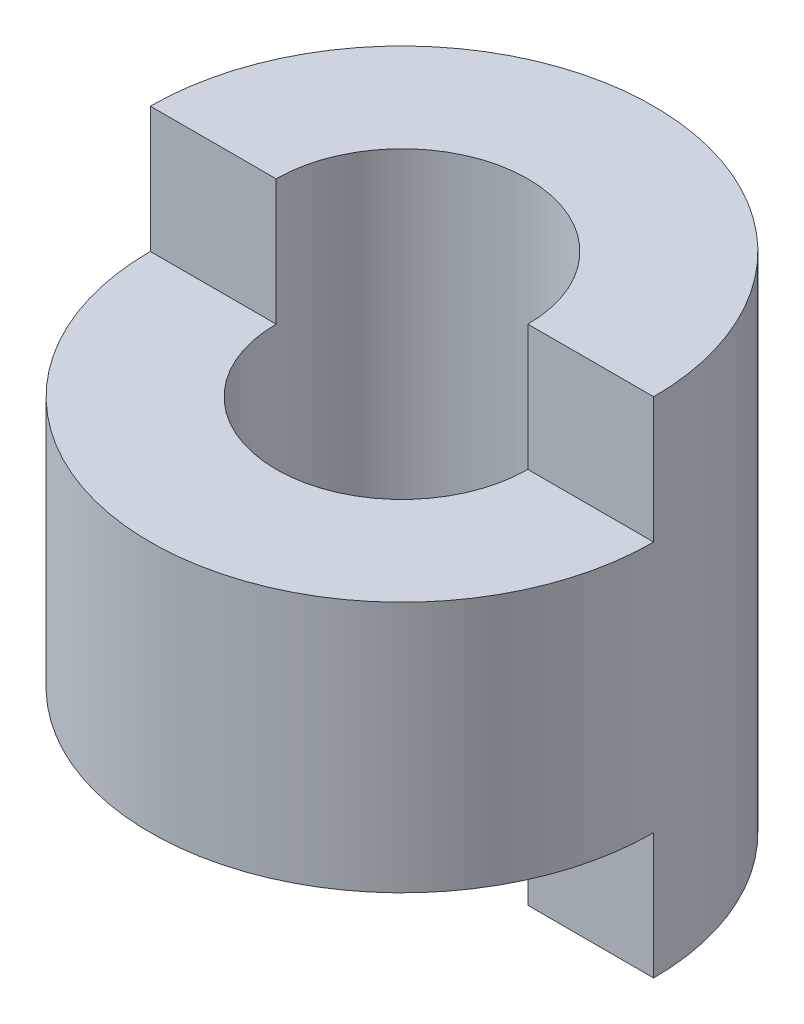
ISO-10303-21;
HEADER;
FILE_DESCRIPTION(('STEP AP214'),'2;1');
FILE_NAME('part.step','',(''),(''),'','','');
FILE_SCHEMA(('AUTOMOTIVE_DESIGN { 1 0 10303 214 1 1 1 1 }'));
ENDSEC;
DATA;
#1=APPLICATION_CONTEXT('core data for automotive mechanical design processes');
#2=APPLICATION_PROTOCOL_DEFINITION('international standard','automotive_design',2000,#1);
#3=PRODUCT_CONTEXT('',#1,'mechanical');
#4=PRODUCT('Part','Part','',(#3));
#5=PRODUCT_RELATED_PRODUCT_CATEGORY('part','',(#4));
#6=PRODUCT_DEFINITION_FORMATION('','',#4);
#7=PRODUCT_DEFINITION_CONTEXT('part definition',#1,'design');
#8=PRODUCT_DEFINITION('design','',#6,#7);
#9=PRODUCT_DEFINITION_SHAPE('','',#8);
#10=(LENGTH_UNIT() NAMED_UNIT(*) SI_UNIT(.MILLI.,.METRE.));
#11=(NAMED_UNIT(*) PLANE_ANGLE_UNIT() SI_UNIT($,.RADIAN.));
#12=(NAMED_UNIT(*) SI_UNIT($,.STERADIAN.) SOLID_ANGLE_UNIT());
#13=UNCERTAINTY_MEASURE_WITH_UNIT(LENGTH_MEASURE(1.E-05),#10,'distance_accuracy_value','');
#14=(GEOMETRIC_REPRESENTATION_CONTEXT(3) GLOBAL_UNCERTAINTY_ASSIGNED_CONTEXT((#13)) GLOBAL_UNIT_ASSIGNED_CONTEXT((#10,
#11,#12)) REPRESENTATION_CONTEXT('',''));
#15=CARTESIAN_POINT('',(0.,0.,0.));
#16=DIRECTION('',(0.,0.,1.));
#17=DIRECTION('',(1.,0.,0.));
#18=AXIS2_PLACEMENT_3D('',#15,#16,#17);
#19=CARTESIAN_POINT('',(0.,20.,0.));
#20=DIRECTION('',(0.,1.,0.));
#21=DIRECTION('',(0.,0.,1.));
#22=AXIS2_PLACEMENT_3D('',#19,#20,#21);
#23=PLANE('',#22);
#24=DIRECTION('',(-1.,0.,0.));
#25=VECTOR('',#24,1.);
#26=CARTESIAN_POINT('',(-10.,20.,0.));
#27=LINE('',#26,#25);
#28=CARTESIAN_POINT('',(-5.,20.,0.));
#29=VERTEX_POINT('',#28);
#30=CARTESIAN_POINT('',(-10.,20.,0.));
#31=VERTEX_POINT('',#30);
#32=EDGE_CURVE('E126',#29,#31,#27,.T.);
#33=ORIENTED_EDGE('',*,*,#32,.F.);
#34=CARTESIAN_POINT('',(0.,20.,0.));
#35=DIRECTION('',(0.,1.,0.));
#36=DIRECTION('',(0.,0.,1.));
#37=AXIS2_PLACEMENT_3D('',#34,#35,#36);
#38=CIRCLE('',#37,5.);
#39=CARTESIAN_POINT('',(5.,20.,0.));
#40=VERTEX_POINT('',#39);
#41=EDGE_CURVE('E141',#40,#29,#38,.T.);
#42=ORIENTED_EDGE('',*,*,#41,.F.);
#43=DIRECTION('',(-1.,0.,0.));
#44=VECTOR('',#43,1.);
#45=CARTESIAN_POINT('',(5.,20.,0.));
#46=LINE('',#45,#44);
#47=CARTESIAN_POINT('',(10.,20.,0.));
#48=VERTEX_POINT('',#47);
#49=EDGE_CURVE('E134',#48,#40,#46,.T.);
#50=ORIENTED_EDGE('',*,*,#49,.F.);
#51=CARTESIAN_POINT('',(0.,20.,0.));
#52=DIRECTION('',(0.,-1.,0.));
#53=DIRECTION('',(0.,0.,-1.));
#54=AXIS2_PLACEMENT_3D('',#51,#52,#53);
#55=CIRCLE('',#54,10.);
#56=EDGE_CURVE('E11',#31,#48,#55,.T.);
#57=ORIENTED_EDGE('',*,*,#56,.F.);
#58=EDGE_LOOP('',(#33,#42,#50,#57));
#59=FACE_BOUND('',#58,.T.);
#60=ADVANCED_FACE('F33',(#59),#23,.T.);
#61=CARTESIAN_POINT('',(0.,0.,0.));
#62=DIRECTION('',(0.,-1.,0.));
#63=DIRECTION('',(0.,0.,-1.));
#64=AXIS2_PLACEMENT_3D('',#61,#62,#63);
#65=CYLINDRICAL_SURFACE('',#64,10.);
#66=DIRECTION('',(0.,-1.,0.));
#67=VECTOR('',#66,1.);
#68=CARTESIAN_POINT('',(10.,5.,0.));
#69=LINE('',#68,#67);
#70=CARTESIAN_POINT('',(10.,5.,0.));
#71=VERTEX_POINT('',#70);
#72=CARTESIAN_POINT('',(10.,0.,0.));
#73=VERTEX_POINT('',#72);
#74=EDGE_CURVE('E136',#71,#73,#69,.T.);
#75=ORIENTED_EDGE('',*,*,#74,.T.);
#76=CARTESIAN_POINT('',(0.,0.,0.));
#77=DIRECTION('',(0.,-1.,0.));
#78=DIRECTION('',(0.,0.,-1.));
#79=AXIS2_PLACEMENT_3D('',#76,#77,#78);
#80=CIRCLE('',#79,10.);
#81=CARTESIAN_POINT('',(-10.,0.,0.));
#82=VERTEX_POINT('',#81);
#83=EDGE_CURVE('E40',#82,#73,#80,.T.);
#84=ORIENTED_EDGE('',*,*,#83,.F.);
#85=DIRECTION('',(0.,-1.,0.));
#86=VECTOR('',#85,1.);
#87=CARTESIAN_POINT('',(-10.,5.,0.));
#88=LINE('',#87,#86);
#89=CARTESIAN_POINT('',(-10.,5.,0.));
#90=VERTEX_POINT('',#89);
#91=EDGE_CURVE('E97',#90,#82,#88,.T.);
#92=ORIENTED_EDGE('',*,*,#91,.F.);
#93=CARTESIAN_POINT('',(0.,5.,0.));
#94=DIRECTION('',(0.,-1.,0.));
#95=DIRECTION('',(0.,0.,1.));
#96=AXIS2_PLACEMENT_3D('',#93,#94,#95);
#97=CIRCLE('',#96,10.);
#98=EDGE_CURVE('E103',#71,#90,#97,.T.);
#99=ORIENTED_EDGE('',*,*,#98,.F.);
#100=EDGE_LOOP('',(#75,#84,#92,#99));
#101=FACE_BOUND('',#100,.T.);
#102=DIRECTION('',(0.,1.,0.));
#103=VECTOR('',#102,1.);
#104=CARTESIAN_POINT('',(-10.,15.,0.));
#105=LINE('',#104,#103);
#106=CARTESIAN_POINT('',(-10.,15.,0.));
#107=VERTEX_POINT('',#106);
#108=EDGE_CURVE('E138',#107,#31,#105,.T.);
#109=ORIENTED_EDGE('',*,*,#108,.T.);
#110=ORIENTED_EDGE('',*,*,#56,.T.);
#111=DIRECTION('',(0.,1.,0.));
#112=VECTOR('',#111,1.);
#113=CARTESIAN_POINT('',(10.,15.,0.));
#114=LINE('',#113,#112);
#115=CARTESIAN_POINT('',(10.,15.,0.));
#116=VERTEX_POINT('',#115);
#117=EDGE_CURVE('E133',#116,#48,#114,.T.);
#118=ORIENTED_EDGE('',*,*,#117,.F.);
#119=CARTESIAN_POINT('',(0.,15.,0.));
#120=DIRECTION('',(0.,1.,0.));
#121=DIRECTION('',(0.,0.,1.));
#122=AXIS2_PLACEMENT_3D('',#119,#120,#121);
#123=CIRCLE('',#122,10.);
#124=EDGE_CURVE('E124',#107,#116,#123,.T.);
#125=ORIENTED_EDGE('',*,*,#124,.F.);
#126=EDGE_LOOP('',(#109,#110,#118,#125));
#127=FACE_BOUND('',#126,.T.);
#128=ADVANCED_FACE('F115',(#101,#127),#65,.T.);
#129=CARTESIAN_POINT('',(0.,0.,0.));
#130=DIRECTION('',(0.,-1.,0.));
#131=DIRECTION('',(0.,0.,-1.));
#132=AXIS2_PLACEMENT_3D('',#129,#130,#131);
#133=PLANE('',#132);
#134=DIRECTION('',(1.,0.,0.));
#135=VECTOR('',#134,1.);
#136=CARTESIAN_POINT('',(5.,0.,0.));
#137=LINE('',#136,#135);
#138=CARTESIAN_POINT('',(5.,0.,0.));
#139=VERTEX_POINT('',#138);
#140=EDGE_CURVE('E112',#139,#73,#137,.T.);
#141=ORIENTED_EDGE('',*,*,#140,.F.);
#142=CARTESIAN_POINT('',(0.,0.,0.));
#143=DIRECTION('',(0.,1.,0.));
#144=DIRECTION('',(0.,0.,1.));
#145=AXIS2_PLACEMENT_3D('',#142,#143,#144);
#146=CIRCLE('',#145,5.);
#147=CARTESIAN_POINT('',(-5.,0.,0.));
#148=VERTEX_POINT('',#147);
#149=EDGE_CURVE('E148',#139,#148,#146,.T.);
#150=ORIENTED_EDGE('',*,*,#149,.T.);
#151=DIRECTION('',(1.,0.,0.));
#152=VECTOR('',#151,1.);
#153=CARTESIAN_POINT('',(-10.,0.,0.));
#154=LINE('',#153,#152);
#155=EDGE_CURVE('E156',#82,#148,#154,.T.);
#156=ORIENTED_EDGE('',*,*,#155,.F.);
#157=ORIENTED_EDGE('',*,*,#83,.T.);
#158=EDGE_LOOP('',(#141,#150,#156,#157));
#159=FACE_BOUND('',#158,.T.);
#160=ADVANCED_FACE('F154',(#159),#133,.T.);
#161=CARTESIAN_POINT('',(0.,0.,0.));
#162=DIRECTION('',(0.,1.,0.));
#163=DIRECTION('',(0.,0.,1.));
#164=AXIS2_PLACEMENT_3D('',#161,#162,#163);
#165=CYLINDRICAL_SURFACE('',#164,5.);
#166=ORIENTED_EDGE('',*,*,#149,.F.);
#167=DIRECTION('',(0.,-1.,0.));
#168=VECTOR('',#167,1.);
#169=CARTESIAN_POINT('',(5.,5.,0.));
#170=LINE('',#169,#168);
#171=CARTESIAN_POINT('',(5.,5.,0.));
#172=VERTEX_POINT('',#171);
#173=EDGE_CURVE('E119',#172,#139,#170,.T.);
#174=ORIENTED_EDGE('',*,*,#173,.F.);
#175=CARTESIAN_POINT('',(0.,5.,0.));
#176=DIRECTION('',(0.,1.,0.));
#177=DIRECTION('',(0.,0.,1.));
#178=AXIS2_PLACEMENT_3D('',#175,#176,#177);
#179=CIRCLE('',#178,5.);
#180=CARTESIAN_POINT('',(-5.,5.,0.));
#181=VERTEX_POINT('',#180);
#182=EDGE_CURVE('E102',#181,#172,#179,.T.);
#183=ORIENTED_EDGE('',*,*,#182,.F.);
#184=DIRECTION('',(0.,-1.,0.));
#185=VECTOR('',#184,1.);
#186=CARTESIAN_POINT('',(-5.,5.,0.));
#187=LINE('',#186,#185);
#188=EDGE_CURVE('E100',#181,#148,#187,.T.);
#189=ORIENTED_EDGE('',*,*,#188,.T.);
#190=EDGE_LOOP('',(#166,#174,#183,#189));
#191=FACE_BOUND('',#190,.T.);
#192=ORIENTED_EDGE('',*,*,#41,.T.);
#193=DIRECTION('',(0.,1.,0.));
#194=VECTOR('',#193,1.);
#195=CARTESIAN_POINT('',(-5.,15.,0.));
#196=LINE('',#195,#194);
#197=CARTESIAN_POINT('',(-5.,15.,0.));
#198=VERTEX_POINT('',#197);
#199=EDGE_CURVE('E142',#198,#29,#196,.T.);
#200=ORIENTED_EDGE('',*,*,#199,.F.);
#201=CARTESIAN_POINT('',(0.,15.,0.));
#202=DIRECTION('',(0.,-1.,0.));
#203=DIRECTION('',(0.,0.,1.));
#204=AXIS2_PLACEMENT_3D('',#201,#202,#203);
#205=CIRCLE('',#204,5.);
#206=CARTESIAN_POINT('',(5.,15.,0.));
#207=VERTEX_POINT('',#206);
#208=EDGE_CURVE('E128',#207,#198,#205,.T.);
#209=ORIENTED_EDGE('',*,*,#208,.F.);
#210=DIRECTION('',(0.,1.,0.));
#211=VECTOR('',#210,1.);
#212=CARTESIAN_POINT('',(5.,15.,0.));
#213=LINE('',#212,#211);
#214=EDGE_CURVE('E144',#207,#40,#213,.T.);
#215=ORIENTED_EDGE('',*,*,#214,.T.);
#216=EDGE_LOOP('',(#192,#200,#209,#215));
#217=FACE_BOUND('',#216,.T.);
#218=ADVANCED_FACE('F165',(#191,#217),#165,.F.);
#219=CARTESIAN_POINT('',(-10.,15.,0.));
#220=DIRECTION('',(0.,0.,-1.));
#221=DIRECTION('',(-1.,0.,0.));
#222=AXIS2_PLACEMENT_3D('',#219,#220,#221);
#223=PLANE('',#222);
#224=ORIENTED_EDGE('',*,*,#32,.T.);
#225=ORIENTED_EDGE('',*,*,#108,.F.);
#226=DIRECTION('',(-1.,0.,0.));
#227=VECTOR('',#226,1.);
#228=CARTESIAN_POINT('',(-10.,15.,0.));
#229=LINE('',#228,#227);
#230=EDGE_CURVE('E130',#198,#107,#229,.T.);
#231=ORIENTED_EDGE('',*,*,#230,.F.);
#232=ORIENTED_EDGE('',*,*,#199,.T.);
#233=EDGE_LOOP('',(#224,#225,#231,#232));
#234=FACE_BOUND('',#233,.T.);
#235=ADVANCED_FACE('F168',(#234),#223,.F.);
#236=CARTESIAN_POINT('',(5.,15.,0.));
#237=DIRECTION('',(0.,0.,-1.));
#238=DIRECTION('',(-1.,0.,0.));
#239=AXIS2_PLACEMENT_3D('',#236,#237,#238);
#240=PLANE('',#239);
#241=ORIENTED_EDGE('',*,*,#49,.T.);
#242=ORIENTED_EDGE('',*,*,#214,.F.);
#243=DIRECTION('',(-1.,0.,0.));
#244=VECTOR('',#243,1.);
#245=CARTESIAN_POINT('',(5.,15.,0.));
#246=LINE('',#245,#244);
#247=EDGE_CURVE('E55',#116,#207,#246,.T.);
#248=ORIENTED_EDGE('',*,*,#247,.F.);
#249=ORIENTED_EDGE('',*,*,#117,.T.);
#250=EDGE_LOOP('',(#241,#242,#248,#249));
#251=FACE_BOUND('',#250,.T.);
#252=ADVANCED_FACE('F183',(#251),#240,.F.);
#253=CARTESIAN_POINT('',(0.,15.,0.));
#254=DIRECTION('',(0.,1.,0.));
#255=DIRECTION('',(0.,0.,1.));
#256=AXIS2_PLACEMENT_3D('',#253,#254,#255);
#257=PLANE('',#256);
#258=ORIENTED_EDGE('',*,*,#124,.T.);
#259=ORIENTED_EDGE('',*,*,#247,.T.);
#260=ORIENTED_EDGE('',*,*,#208,.T.);
#261=ORIENTED_EDGE('',*,*,#230,.T.);
#262=EDGE_LOOP('',(#258,#259,#260,#261));
#263=FACE_BOUND('',#262,.T.);
#264=ADVANCED_FACE('F181',(#263),#257,.T.);
#265=CARTESIAN_POINT('',(5.,5.,0.));
#266=DIRECTION('',(0.,0.,-1.));
#267=DIRECTION('',(-1.,0.,0.));
#268=AXIS2_PLACEMENT_3D('',#265,#266,#267);
#269=PLANE('',#268);
#270=ORIENTED_EDGE('',*,*,#140,.T.);
#271=ORIENTED_EDGE('',*,*,#74,.F.);
#272=DIRECTION('',(1.,0.,0.));
#273=VECTOR('',#272,1.);
#274=CARTESIAN_POINT('',(5.,5.,0.));
#275=LINE('',#274,#273);
#276=EDGE_CURVE('E109',#172,#71,#275,.T.);
#277=ORIENTED_EDGE('',*,*,#276,.F.);
#278=ORIENTED_EDGE('',*,*,#173,.T.);
#279=EDGE_LOOP('',(#270,#271,#277,#278));
#280=FACE_BOUND('',#279,.T.);
#281=ADVANCED_FACE('F163',(#280),#269,.F.);
#282=CARTESIAN_POINT('',(-10.,5.,0.));
#283=DIRECTION('',(0.,0.,-1.));
#284=DIRECTION('',(-1.,0.,0.));
#285=AXIS2_PLACEMENT_3D('',#282,#283,#284);
#286=PLANE('',#285);
#287=ORIENTED_EDGE('',*,*,#155,.T.);
#288=ORIENTED_EDGE('',*,*,#188,.F.);
#289=DIRECTION('',(1.,0.,0.));
#290=VECTOR('',#289,1.);
#291=CARTESIAN_POINT('',(-10.,5.,0.));
#292=LINE('',#291,#290);
#293=EDGE_CURVE('E47',#90,#181,#292,.T.);
#294=ORIENTED_EDGE('',*,*,#293,.F.);
#295=ORIENTED_EDGE('',*,*,#91,.T.);
#296=EDGE_LOOP('',(#287,#288,#294,#295));
#297=FACE_BOUND('',#296,.T.);
#298=ADVANCED_FACE('F95',(#297),#286,.F.);
#299=CARTESIAN_POINT('',(0.,5.,0.));
#300=DIRECTION('',(0.,1.,0.));
#301=DIRECTION('',(0.,0.,1.));
#302=AXIS2_PLACEMENT_3D('',#299,#300,#301);
#303=PLANE('',#302);
#304=ORIENTED_EDGE('',*,*,#98,.T.);
#305=ORIENTED_EDGE('',*,*,#293,.T.);
#306=ORIENTED_EDGE('',*,*,#182,.T.);
#307=ORIENTED_EDGE('',*,*,#276,.T.);
#308=EDGE_LOOP('',(#304,#305,#306,#307));
#309=FACE_BOUND('',#308,.T.);
#310=ADVANCED_FACE('F107',(#309),#303,.F.);
#311=CLOSED_SHELL('',(#60,#128,#160,#218,#235,#252,#264,#281,#298,#310));
#312=MANIFOLD_SOLID_BREP('B2',#311);
#313=ADVANCED_BREP_SHAPE_REPRESENTATION('',(#18,#312),#14);
#314=SHAPE_DEFINITION_REPRESENTATION(#9,#313);
ENDSEC;
END-ISO-10303-21;
